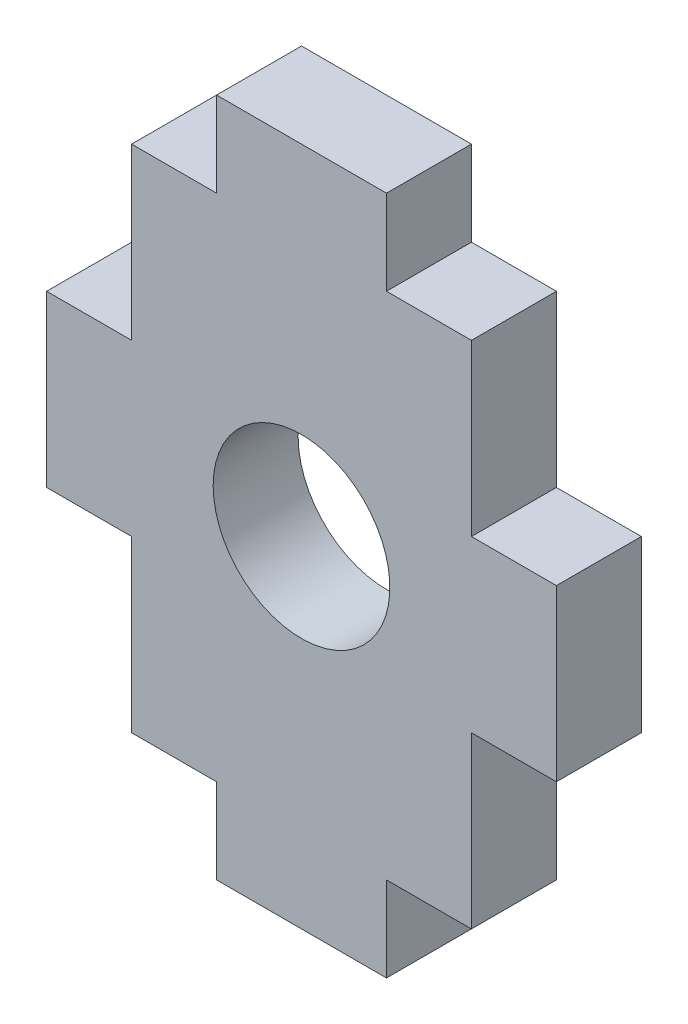
ISO-10303-21;
HEADER;
FILE_DESCRIPTION(('STEP AP214'),'2;1');
FILE_NAME('part.step','',(''),(''),'','','');
FILE_SCHEMA(('AUTOMOTIVE_DESIGN { 1 0 10303 214 1 1 1 1 }'));
ENDSEC;
DATA;
#1=APPLICATION_CONTEXT('core data for automotive mechanical design processes');
#2=APPLICATION_PROTOCOL_DEFINITION('international standard','automotive_design',2000,#1);
#3=PRODUCT_CONTEXT('',#1,'mechanical');
#4=PRODUCT('Part','Part','',(#3));
#5=PRODUCT_RELATED_PRODUCT_CATEGORY('part','',(#4));
#6=PRODUCT_DEFINITION_FORMATION('','',#4);
#7=PRODUCT_DEFINITION_CONTEXT('part definition',#1,'design');
#8=PRODUCT_DEFINITION('design','',#6,#7);
#9=PRODUCT_DEFINITION_SHAPE('','',#8);
#10=(LENGTH_UNIT() NAMED_UNIT(*) SI_UNIT(.MILLI.,.METRE.));
#11=(NAMED_UNIT(*) PLANE_ANGLE_UNIT() SI_UNIT($,.RADIAN.));
#12=(NAMED_UNIT(*) SI_UNIT($,.STERADIAN.) SOLID_ANGLE_UNIT());
#13=UNCERTAINTY_MEASURE_WITH_UNIT(LENGTH_MEASURE(1.E-05),#10,'distance_accuracy_value','');
#14=(GEOMETRIC_REPRESENTATION_CONTEXT(3) GLOBAL_UNCERTAINTY_ASSIGNED_CONTEXT((#13)) GLOBAL_UNIT_ASSIGNED_CONTEXT((#10,
#11,#12)) REPRESENTATION_CONTEXT('',''));
#15=CARTESIAN_POINT('',(0.,0.,0.));
#16=DIRECTION('',(0.,0.,1.));
#17=DIRECTION('',(1.,0.,0.));
#18=AXIS2_PLACEMENT_3D('',#15,#16,#17);
#19=CARTESIAN_POINT('',(-6.35,9.525,3.175));
#20=DIRECTION('',(0.,-1.,0.));
#21=DIRECTION('',(0.,0.,-1.));
#22=AXIS2_PLACEMENT_3D('',#19,#20,#21);
#23=PLANE('',#22);
#24=DIRECTION('',(-1.,0.,0.));
#25=VECTOR('',#24,1.);
#26=CARTESIAN_POINT('',(-6.35,9.525,0.));
#27=LINE('',#26,#25);
#28=CARTESIAN_POINT('',(-3.175,9.525,0.));
#29=VERTEX_POINT('',#28);
#30=CARTESIAN_POINT('',(-6.35,9.525,0.));
#31=VERTEX_POINT('',#30);
#32=EDGE_CURVE('E201',#29,#31,#27,.T.);
#33=ORIENTED_EDGE('',*,*,#32,.T.);
#34=DIRECTION('',(0.,0.,-1.));
#35=VECTOR('',#34,1.);
#36=CARTESIAN_POINT('',(-6.35,9.525,3.175));
#37=LINE('',#36,#35);
#38=CARTESIAN_POINT('',(-6.35,9.525,3.175));
#39=VERTEX_POINT('',#38);
#40=EDGE_CURVE('E11',#39,#31,#37,.T.);
#41=ORIENTED_EDGE('',*,*,#40,.F.);
#42=DIRECTION('',(-1.,0.,0.));
#43=VECTOR('',#42,1.);
#44=CARTESIAN_POINT('',(-6.35,9.525,3.175));
#45=LINE('',#44,#43);
#46=CARTESIAN_POINT('',(-3.175,9.525,3.175));
#47=VERTEX_POINT('',#46);
#48=EDGE_CURVE('E240',#47,#39,#45,.T.);
#49=ORIENTED_EDGE('',*,*,#48,.F.);
#50=DIRECTION('',(0.,0.,-1.));
#51=VECTOR('',#50,1.);
#52=CARTESIAN_POINT('',(-3.175,9.525,3.175));
#53=LINE('',#52,#51);
#54=EDGE_CURVE('E197',#47,#29,#53,.T.);
#55=ORIENTED_EDGE('',*,*,#54,.T.);
#56=EDGE_LOOP('',(#33,#41,#49,#55));
#57=FACE_BOUND('',#56,.T.);
#58=ADVANCED_FACE('F33',(#57),#23,.F.);
#59=CARTESIAN_POINT('',(-6.35,9.525,3.175));
#60=DIRECTION('',(1.,0.,0.));
#61=DIRECTION('',(0.,1.,0.));
#62=AXIS2_PLACEMENT_3D('',#59,#60,#61);
#63=PLANE('',#62);
#64=DIRECTION('',(0.,-1.,0.));
#65=VECTOR('',#64,1.);
#66=CARTESIAN_POINT('',(-6.35,9.525,0.));
#67=LINE('',#66,#65);
#68=CARTESIAN_POINT('',(-6.35,3.175,0.));
#69=VERTEX_POINT('',#68);
#70=EDGE_CURVE('E204',#31,#69,#67,.T.);
#71=ORIENTED_EDGE('',*,*,#70,.T.);
#72=DIRECTION('',(0.,0.,-1.));
#73=VECTOR('',#72,1.);
#74=CARTESIAN_POINT('',(-6.35,3.175,3.175));
#75=LINE('',#74,#73);
#76=CARTESIAN_POINT('',(-6.35,3.175,3.175));
#77=VERTEX_POINT('',#76);
#78=EDGE_CURVE('E41',#77,#69,#75,.T.);
#79=ORIENTED_EDGE('',*,*,#78,.F.);
#80=DIRECTION('',(0.,-1.,0.));
#81=VECTOR('',#80,1.);
#82=CARTESIAN_POINT('',(-6.35,9.525,3.175));
#83=LINE('',#82,#81);
#84=EDGE_CURVE('E128',#39,#77,#83,.T.);
#85=ORIENTED_EDGE('',*,*,#84,.F.);
#86=ORIENTED_EDGE('',*,*,#40,.T.);
#87=EDGE_LOOP('',(#71,#79,#85,#86));
#88=FACE_BOUND('',#87,.T.);
#89=ADVANCED_FACE('F359',(#88),#63,.F.);
#90=CARTESIAN_POINT('',(-6.35,3.175,3.175));
#91=DIRECTION('',(0.,-1.,0.));
#92=DIRECTION('',(1.,0.,0.));
#93=AXIS2_PLACEMENT_3D('',#90,#91,#92);
#94=PLANE('',#93);
#95=DIRECTION('',(-1.,0.,0.));
#96=VECTOR('',#95,1.);
#97=CARTESIAN_POINT('',(-6.35,3.175,0.));
#98=LINE('',#97,#96);
#99=CARTESIAN_POINT('',(-9.525,3.175,0.));
#100=VERTEX_POINT('',#99);
#101=EDGE_CURVE('E207',#69,#100,#98,.T.);
#102=ORIENTED_EDGE('',*,*,#101,.T.);
#103=DIRECTION('',(0.,0.,-1.));
#104=VECTOR('',#103,1.);
#105=CARTESIAN_POINT('',(-9.525,3.175,3.175));
#106=LINE('',#105,#104);
#107=CARTESIAN_POINT('',(-9.525,3.175,3.175));
#108=VERTEX_POINT('',#107);
#109=EDGE_CURVE('E283',#108,#100,#106,.T.);
#110=ORIENTED_EDGE('',*,*,#109,.F.);
#111=DIRECTION('',(-1.,0.,0.));
#112=VECTOR('',#111,1.);
#113=CARTESIAN_POINT('',(-6.35,3.175,3.175));
#114=LINE('',#113,#112);
#115=EDGE_CURVE('E291',#77,#108,#114,.T.);
#116=ORIENTED_EDGE('',*,*,#115,.F.);
#117=ORIENTED_EDGE('',*,*,#78,.T.);
#118=EDGE_LOOP('',(#102,#110,#116,#117));
#119=FACE_BOUND('',#118,.T.);
#120=ADVANCED_FACE('F289',(#119),#94,.F.);
#121=CARTESIAN_POINT('',(-9.525,3.175,3.175));
#122=DIRECTION('',(1.,0.,0.));
#123=DIRECTION('',(0.,0.,-1.));
#124=AXIS2_PLACEMENT_3D('',#121,#122,#123);
#125=PLANE('',#124);
#126=DIRECTION('',(0.,-1.,0.));
#127=VECTOR('',#126,1.);
#128=CARTESIAN_POINT('',(-9.525,3.175,0.));
#129=LINE('',#128,#127);
#130=CARTESIAN_POINT('',(-9.525,-3.175,0.));
#131=VERTEX_POINT('',#130);
#132=EDGE_CURVE('E209',#100,#131,#129,.T.);
#133=ORIENTED_EDGE('',*,*,#132,.T.);
#134=DIRECTION('',(0.,0.,-1.));
#135=VECTOR('',#134,1.);
#136=CARTESIAN_POINT('',(-9.525,-3.175,3.175));
#137=LINE('',#136,#135);
#138=CARTESIAN_POINT('',(-9.525,-3.175,3.175));
#139=VERTEX_POINT('',#138);
#140=EDGE_CURVE('E280',#139,#131,#137,.T.);
#141=ORIENTED_EDGE('',*,*,#140,.F.);
#142=DIRECTION('',(0.,-1.,0.));
#143=VECTOR('',#142,1.);
#144=CARTESIAN_POINT('',(-9.525,3.175,3.175));
#145=LINE('',#144,#143);
#146=EDGE_CURVE('E309',#108,#139,#145,.T.);
#147=ORIENTED_EDGE('',*,*,#146,.F.);
#148=ORIENTED_EDGE('',*,*,#109,.T.);
#149=EDGE_LOOP('',(#133,#141,#147,#148));
#150=FACE_BOUND('',#149,.T.);
#151=ADVANCED_FACE('F300',(#150),#125,.F.);
#152=CARTESIAN_POINT('',(-6.35,-3.175,3.175));
#153=DIRECTION('',(0.,1.,0.));
#154=DIRECTION('',(-1.,0.,0.));
#155=AXIS2_PLACEMENT_3D('',#152,#153,#154);
#156=PLANE('',#155);
#157=DIRECTION('',(1.,0.,0.));
#158=VECTOR('',#157,1.);
#159=CARTESIAN_POINT('',(-6.35,-3.175,0.));
#160=LINE('',#159,#158);
#161=CARTESIAN_POINT('',(-6.35,-3.175,0.));
#162=VERTEX_POINT('',#161);
#163=EDGE_CURVE('E211',#131,#162,#160,.T.);
#164=ORIENTED_EDGE('',*,*,#163,.T.);
#165=DIRECTION('',(0.,0.,-1.));
#166=VECTOR('',#165,1.);
#167=CARTESIAN_POINT('',(-6.35,-3.175,3.175));
#168=LINE('',#167,#166);
#169=CARTESIAN_POINT('',(-6.35,-3.175,3.175));
#170=VERTEX_POINT('',#169);
#171=EDGE_CURVE('E277',#170,#162,#168,.T.);
#172=ORIENTED_EDGE('',*,*,#171,.F.);
#173=DIRECTION('',(1.,0.,0.));
#174=VECTOR('',#173,1.);
#175=CARTESIAN_POINT('',(-6.35,-3.175,3.175));
#176=LINE('',#175,#174);
#177=EDGE_CURVE('E306',#139,#170,#176,.T.);
#178=ORIENTED_EDGE('',*,*,#177,.F.);
#179=ORIENTED_EDGE('',*,*,#140,.T.);
#180=EDGE_LOOP('',(#164,#172,#178,#179));
#181=FACE_BOUND('',#180,.T.);
#182=ADVANCED_FACE('F304',(#181),#156,.F.);
#183=CARTESIAN_POINT('',(-6.35,-9.525,3.175));
#184=DIRECTION('',(1.,0.,0.));
#185=DIRECTION('',(0.,1.,0.));
#186=AXIS2_PLACEMENT_3D('',#183,#184,#185);
#187=PLANE('',#186);
#188=DIRECTION('',(0.,-1.,0.));
#189=VECTOR('',#188,1.);
#190=CARTESIAN_POINT('',(-6.35,-9.525,0.));
#191=LINE('',#190,#189);
#192=CARTESIAN_POINT('',(-6.35,-9.525,0.));
#193=VERTEX_POINT('',#192);
#194=EDGE_CURVE('E213',#162,#193,#191,.T.);
#195=ORIENTED_EDGE('',*,*,#194,.T.);
#196=DIRECTION('',(0.,0.,-1.));
#197=VECTOR('',#196,1.);
#198=CARTESIAN_POINT('',(-6.35,-9.525,3.175));
#199=LINE('',#198,#197);
#200=CARTESIAN_POINT('',(-6.35,-9.525,3.175));
#201=VERTEX_POINT('',#200);
#202=EDGE_CURVE('E274',#201,#193,#199,.T.);
#203=ORIENTED_EDGE('',*,*,#202,.F.);
#204=DIRECTION('',(0.,-1.,0.));
#205=VECTOR('',#204,1.);
#206=CARTESIAN_POINT('',(-6.35,-9.525,3.175));
#207=LINE('',#206,#205);
#208=EDGE_CURVE('E308',#170,#201,#207,.T.);
#209=ORIENTED_EDGE('',*,*,#208,.F.);
#210=ORIENTED_EDGE('',*,*,#171,.T.);
#211=EDGE_LOOP('',(#195,#203,#209,#210));
#212=FACE_BOUND('',#211,.T.);
#213=ADVANCED_FACE('F372',(#212),#187,.F.);
#214=CARTESIAN_POINT('',(-6.35,-9.525,3.175));
#215=DIRECTION('',(0.,1.,0.));
#216=DIRECTION('',(0.,0.,1.));
#217=AXIS2_PLACEMENT_3D('',#214,#215,#216);
#218=PLANE('',#217);
#219=DIRECTION('',(1.,0.,0.));
#220=VECTOR('',#219,1.);
#221=CARTESIAN_POINT('',(-6.35,-9.525,0.));
#222=LINE('',#221,#220);
#223=CARTESIAN_POINT('',(-3.175,-9.525,0.));
#224=VERTEX_POINT('',#223);
#225=EDGE_CURVE('E215',#193,#224,#222,.T.);
#226=ORIENTED_EDGE('',*,*,#225,.T.);
#227=DIRECTION('',(0.,0.,-1.));
#228=VECTOR('',#227,1.);
#229=CARTESIAN_POINT('',(-3.175,-9.525,3.175));
#230=LINE('',#229,#228);
#231=CARTESIAN_POINT('',(-3.175,-9.525,3.175));
#232=VERTEX_POINT('',#231);
#233=EDGE_CURVE('E271',#232,#224,#230,.T.);
#234=ORIENTED_EDGE('',*,*,#233,.F.);
#235=DIRECTION('',(1.,0.,0.));
#236=VECTOR('',#235,1.);
#237=CARTESIAN_POINT('',(-6.35,-9.525,3.175));
#238=LINE('',#237,#236);
#239=EDGE_CURVE('E311',#201,#232,#238,.T.);
#240=ORIENTED_EDGE('',*,*,#239,.F.);
#241=ORIENTED_EDGE('',*,*,#202,.T.);
#242=EDGE_LOOP('',(#226,#234,#240,#241));
#243=FACE_BOUND('',#242,.T.);
#244=ADVANCED_FACE('F375',(#243),#218,.F.);
#245=CARTESIAN_POINT('',(-3.175,-12.7,3.175));
#246=DIRECTION('',(1.,0.,0.));
#247=DIRECTION('',(0.,1.,0.));
#248=AXIS2_PLACEMENT_3D('',#245,#246,#247);
#249=PLANE('',#248);
#250=DIRECTION('',(0.,-1.,0.));
#251=VECTOR('',#250,1.);
#252=CARTESIAN_POINT('',(-3.175,-12.7,0.));
#253=LINE('',#252,#251);
#254=CARTESIAN_POINT('',(-3.175,-12.7,0.));
#255=VERTEX_POINT('',#254);
#256=EDGE_CURVE('E217',#224,#255,#253,.T.);
#257=ORIENTED_EDGE('',*,*,#256,.T.);
#258=DIRECTION('',(0.,0.,-1.));
#259=VECTOR('',#258,1.);
#260=CARTESIAN_POINT('',(-3.175,-12.7,3.175));
#261=LINE('',#260,#259);
#262=CARTESIAN_POINT('',(-3.175,-12.7,3.175));
#263=VERTEX_POINT('',#262);
#264=EDGE_CURVE('E268',#263,#255,#261,.T.);
#265=ORIENTED_EDGE('',*,*,#264,.F.);
#266=DIRECTION('',(0.,-1.,0.));
#267=VECTOR('',#266,1.);
#268=CARTESIAN_POINT('',(-3.175,-12.7,3.175));
#269=LINE('',#268,#267);
#270=EDGE_CURVE('E317',#232,#263,#269,.T.);
#271=ORIENTED_EDGE('',*,*,#270,.F.);
#272=ORIENTED_EDGE('',*,*,#233,.T.);
#273=EDGE_LOOP('',(#257,#265,#271,#272));
#274=FACE_BOUND('',#273,.T.);
#275=ADVANCED_FACE('F379',(#274),#249,.F.);
#276=CARTESIAN_POINT('',(-3.175,-12.7,3.175));
#277=DIRECTION('',(0.,1.,0.));
#278=DIRECTION('',(0.,0.,1.));
#279=AXIS2_PLACEMENT_3D('',#276,#277,#278);
#280=PLANE('',#279);
#281=DIRECTION('',(1.,0.,0.));
#282=VECTOR('',#281,1.);
#283=CARTESIAN_POINT('',(-3.175,-12.7,0.));
#284=LINE('',#283,#282);
#285=CARTESIAN_POINT('',(3.175,-12.7,0.));
#286=VERTEX_POINT('',#285);
#287=EDGE_CURVE('E219',#255,#286,#284,.T.);
#288=ORIENTED_EDGE('',*,*,#287,.T.);
#289=DIRECTION('',(0.,0.,-1.));
#290=VECTOR('',#289,1.);
#291=CARTESIAN_POINT('',(3.175,-12.7,3.175));
#292=LINE('',#291,#290);
#293=CARTESIAN_POINT('',(3.175,-12.7,3.175));
#294=VERTEX_POINT('',#293);
#295=EDGE_CURVE('E265',#294,#286,#292,.T.);
#296=ORIENTED_EDGE('',*,*,#295,.F.);
#297=DIRECTION('',(1.,0.,0.));
#298=VECTOR('',#297,1.);
#299=CARTESIAN_POINT('',(-3.175,-12.7,3.175));
#300=LINE('',#299,#298);
#301=EDGE_CURVE('E319',#263,#294,#300,.T.);
#302=ORIENTED_EDGE('',*,*,#301,.F.);
#303=ORIENTED_EDGE('',*,*,#264,.T.);
#304=EDGE_LOOP('',(#288,#296,#302,#303));
#305=FACE_BOUND('',#304,.T.);
#306=ADVANCED_FACE('F383',(#305),#280,.F.);
#307=CARTESIAN_POINT('',(3.175,-12.7,3.175));
#308=DIRECTION('',(-1.,0.,0.));
#309=DIRECTION('',(0.,-1.,0.));
#310=AXIS2_PLACEMENT_3D('',#307,#308,#309);
#311=PLANE('',#310);
#312=DIRECTION('',(0.,1.,0.));
#313=VECTOR('',#312,1.);
#314=CARTESIAN_POINT('',(3.175,-12.7,0.));
#315=LINE('',#314,#313);
#316=CARTESIAN_POINT('',(3.175,-9.525,0.));
#317=VERTEX_POINT('',#316);
#318=EDGE_CURVE('E221',#286,#317,#315,.T.);
#319=ORIENTED_EDGE('',*,*,#318,.T.);
#320=DIRECTION('',(0.,0.,-1.));
#321=VECTOR('',#320,1.);
#322=CARTESIAN_POINT('',(3.175,-9.525,3.175));
#323=LINE('',#322,#321);
#324=CARTESIAN_POINT('',(3.175,-9.525,3.175));
#325=VERTEX_POINT('',#324);
#326=EDGE_CURVE('E262',#325,#317,#323,.T.);
#327=ORIENTED_EDGE('',*,*,#326,.F.);
#328=DIRECTION('',(0.,1.,0.));
#329=VECTOR('',#328,1.);
#330=CARTESIAN_POINT('',(3.175,-12.7,3.175));
#331=LINE('',#330,#329);
#332=EDGE_CURVE('E321',#294,#325,#331,.T.);
#333=ORIENTED_EDGE('',*,*,#332,.F.);
#334=ORIENTED_EDGE('',*,*,#295,.T.);
#335=EDGE_LOOP('',(#319,#327,#333,#334));
#336=FACE_BOUND('',#335,.T.);
#337=ADVANCED_FACE('F387',(#336),#311,.F.);
#338=CARTESIAN_POINT('',(3.175,-9.525,3.175));
#339=DIRECTION('',(0.,1.,0.));
#340=DIRECTION('',(0.,0.,1.));
#341=AXIS2_PLACEMENT_3D('',#338,#339,#340);
#342=PLANE('',#341);
#343=DIRECTION('',(1.,0.,0.));
#344=VECTOR('',#343,1.);
#345=CARTESIAN_POINT('',(3.175,-9.525,0.));
#346=LINE('',#345,#344);
#347=CARTESIAN_POINT('',(6.35,-9.525,0.));
#348=VERTEX_POINT('',#347);
#349=EDGE_CURVE('E223',#317,#348,#346,.T.);
#350=ORIENTED_EDGE('',*,*,#349,.T.);
#351=DIRECTION('',(0.,0.,-1.));
#352=VECTOR('',#351,1.);
#353=CARTESIAN_POINT('',(6.35,-9.525,3.175));
#354=LINE('',#353,#352);
#355=CARTESIAN_POINT('',(6.35,-9.525,3.175));
#356=VERTEX_POINT('',#355);
#357=EDGE_CURVE('E259',#356,#348,#354,.T.);
#358=ORIENTED_EDGE('',*,*,#357,.F.);
#359=DIRECTION('',(1.,0.,0.));
#360=VECTOR('',#359,1.);
#361=CARTESIAN_POINT('',(3.175,-9.525,3.175));
#362=LINE('',#361,#360);
#363=EDGE_CURVE('E323',#325,#356,#362,.T.);
#364=ORIENTED_EDGE('',*,*,#363,.F.);
#365=ORIENTED_EDGE('',*,*,#326,.T.);
#366=EDGE_LOOP('',(#350,#358,#364,#365));
#367=FACE_BOUND('',#366,.T.);
#368=ADVANCED_FACE('F391',(#367),#342,.F.);
#369=CARTESIAN_POINT('',(6.35,-9.525,3.175));
#370=DIRECTION('',(-1.,0.,0.));
#371=DIRECTION('',(0.,-1.,0.));
#372=AXIS2_PLACEMENT_3D('',#369,#370,#371);
#373=PLANE('',#372);
#374=DIRECTION('',(0.,1.,0.));
#375=VECTOR('',#374,1.);
#376=CARTESIAN_POINT('',(6.35,-9.525,0.));
#377=LINE('',#376,#375);
#378=CARTESIAN_POINT('',(6.35,-3.175,0.));
#379=VERTEX_POINT('',#378);
#380=EDGE_CURVE('E225',#348,#379,#377,.T.);
#381=ORIENTED_EDGE('',*,*,#380,.T.);
#382=DIRECTION('',(0.,0.,-1.));
#383=VECTOR('',#382,1.);
#384=CARTESIAN_POINT('',(6.35,-3.175,3.175));
#385=LINE('',#384,#383);
#386=CARTESIAN_POINT('',(6.35,-3.175,3.175));
#387=VERTEX_POINT('',#386);
#388=EDGE_CURVE('E256',#387,#379,#385,.T.);
#389=ORIENTED_EDGE('',*,*,#388,.F.);
#390=DIRECTION('',(0.,1.,0.));
#391=VECTOR('',#390,1.);
#392=CARTESIAN_POINT('',(6.35,-9.525,3.175));
#393=LINE('',#392,#391);
#394=EDGE_CURVE('E325',#356,#387,#393,.T.);
#395=ORIENTED_EDGE('',*,*,#394,.F.);
#396=ORIENTED_EDGE('',*,*,#357,.T.);
#397=EDGE_LOOP('',(#381,#389,#395,#396));
#398=FACE_BOUND('',#397,.T.);
#399=ADVANCED_FACE('F395',(#398),#373,.F.);
#400=CARTESIAN_POINT('',(6.35,-3.175,3.175));
#401=DIRECTION('',(0.,1.,0.));
#402=DIRECTION('',(-1.,0.,0.));
#403=AXIS2_PLACEMENT_3D('',#400,#401,#402);
#404=PLANE('',#403);
#405=DIRECTION('',(1.,0.,0.));
#406=VECTOR('',#405,1.);
#407=CARTESIAN_POINT('',(6.35,-3.175,0.));
#408=LINE('',#407,#406);
#409=CARTESIAN_POINT('',(9.525,-3.175,0.));
#410=VERTEX_POINT('',#409);
#411=EDGE_CURVE('E227',#379,#410,#408,.T.);
#412=ORIENTED_EDGE('',*,*,#411,.T.);
#413=DIRECTION('',(0.,0.,-1.));
#414=VECTOR('',#413,1.);
#415=CARTESIAN_POINT('',(9.525,-3.175,3.175));
#416=LINE('',#415,#414);
#417=CARTESIAN_POINT('',(9.525,-3.175,3.175));
#418=VERTEX_POINT('',#417);
#419=EDGE_CURVE('E253',#418,#410,#416,.T.);
#420=ORIENTED_EDGE('',*,*,#419,.F.);
#421=DIRECTION('',(1.,0.,0.));
#422=VECTOR('',#421,1.);
#423=CARTESIAN_POINT('',(6.35,-3.175,3.175));
#424=LINE('',#423,#422);
#425=EDGE_CURVE('E327',#387,#418,#424,.T.);
#426=ORIENTED_EDGE('',*,*,#425,.F.);
#427=ORIENTED_EDGE('',*,*,#388,.T.);
#428=EDGE_LOOP('',(#412,#420,#426,#427));
#429=FACE_BOUND('',#428,.T.);
#430=ADVANCED_FACE('F399',(#429),#404,.F.);
#431=CARTESIAN_POINT('',(9.525,3.175,3.175));
#432=DIRECTION('',(-1.,0.,0.));
#433=DIRECTION('',(0.,0.,1.));
#434=AXIS2_PLACEMENT_3D('',#431,#432,#433);
#435=PLANE('',#434);
#436=DIRECTION('',(0.,1.,0.));
#437=VECTOR('',#436,1.);
#438=CARTESIAN_POINT('',(9.525,3.175,0.));
#439=LINE('',#438,#437);
#440=CARTESIAN_POINT('',(9.525,3.175,0.));
#441=VERTEX_POINT('',#440);
#442=EDGE_CURVE('E229',#410,#441,#439,.T.);
#443=ORIENTED_EDGE('',*,*,#442,.T.);
#444=DIRECTION('',(0.,0.,-1.));
#445=VECTOR('',#444,1.);
#446=CARTESIAN_POINT('',(9.525,3.175,3.175));
#447=LINE('',#446,#445);
#448=CARTESIAN_POINT('',(9.525,3.175,3.175));
#449=VERTEX_POINT('',#448);
#450=EDGE_CURVE('E250',#449,#441,#447,.T.);
#451=ORIENTED_EDGE('',*,*,#450,.F.);
#452=DIRECTION('',(0.,1.,0.));
#453=VECTOR('',#452,1.);
#454=CARTESIAN_POINT('',(9.525,3.175,3.175));
#455=LINE('',#454,#453);
#456=EDGE_CURVE('E329',#418,#449,#455,.T.);
#457=ORIENTED_EDGE('',*,*,#456,.F.);
#458=ORIENTED_EDGE('',*,*,#419,.T.);
#459=EDGE_LOOP('',(#443,#451,#457,#458));
#460=FACE_BOUND('',#459,.T.);
#461=ADVANCED_FACE('F403',(#460),#435,.F.);
#462=CARTESIAN_POINT('',(6.35,3.175,3.175));
#463=DIRECTION('',(0.,-1.,0.));
#464=DIRECTION('',(1.,0.,0.));
#465=AXIS2_PLACEMENT_3D('',#462,#463,#464);
#466=PLANE('',#465);
#467=DIRECTION('',(-1.,0.,0.));
#468=VECTOR('',#467,1.);
#469=CARTESIAN_POINT('',(6.35,3.175,0.));
#470=LINE('',#469,#468);
#471=CARTESIAN_POINT('',(6.35,3.175,0.));
#472=VERTEX_POINT('',#471);
#473=EDGE_CURVE('E231',#441,#472,#470,.T.);
#474=ORIENTED_EDGE('',*,*,#473,.T.);
#475=DIRECTION('',(0.,0.,-1.));
#476=VECTOR('',#475,1.);
#477=CARTESIAN_POINT('',(6.35,3.175,3.175));
#478=LINE('',#477,#476);
#479=CARTESIAN_POINT('',(6.35,3.175,3.175));
#480=VERTEX_POINT('',#479);
#481=EDGE_CURVE('E247',#480,#472,#478,.T.);
#482=ORIENTED_EDGE('',*,*,#481,.F.);
#483=DIRECTION('',(-1.,0.,0.));
#484=VECTOR('',#483,1.);
#485=CARTESIAN_POINT('',(6.35,3.175,3.175));
#486=LINE('',#485,#484);
#487=EDGE_CURVE('E331',#449,#480,#486,.T.);
#488=ORIENTED_EDGE('',*,*,#487,.F.);
#489=ORIENTED_EDGE('',*,*,#450,.T.);
#490=EDGE_LOOP('',(#474,#482,#488,#489));
#491=FACE_BOUND('',#490,.T.);
#492=ADVANCED_FACE('F407',(#491),#466,.F.);
#493=CARTESIAN_POINT('',(6.35,9.525,3.175));
#494=DIRECTION('',(-1.,0.,0.));
#495=DIRECTION('',(0.,-1.,0.));
#496=AXIS2_PLACEMENT_3D('',#493,#494,#495);
#497=PLANE('',#496);
#498=DIRECTION('',(0.,1.,0.));
#499=VECTOR('',#498,1.);
#500=CARTESIAN_POINT('',(6.35,9.525,0.));
#501=LINE('',#500,#499);
#502=CARTESIAN_POINT('',(6.35,9.525,0.));
#503=VERTEX_POINT('',#502);
#504=EDGE_CURVE('E233',#472,#503,#501,.T.);
#505=ORIENTED_EDGE('',*,*,#504,.T.);
#506=DIRECTION('',(0.,0.,-1.));
#507=VECTOR('',#506,1.);
#508=CARTESIAN_POINT('',(6.35,9.525,3.175));
#509=LINE('',#508,#507);
#510=CARTESIAN_POINT('',(6.35,9.525,3.175));
#511=VERTEX_POINT('',#510);
#512=EDGE_CURVE('E244',#511,#503,#509,.T.);
#513=ORIENTED_EDGE('',*,*,#512,.F.);
#514=DIRECTION('',(0.,1.,0.));
#515=VECTOR('',#514,1.);
#516=CARTESIAN_POINT('',(6.35,9.525,3.175));
#517=LINE('',#516,#515);
#518=EDGE_CURVE('E333',#480,#511,#517,.T.);
#519=ORIENTED_EDGE('',*,*,#518,.F.);
#520=ORIENTED_EDGE('',*,*,#481,.T.);
#521=EDGE_LOOP('',(#505,#513,#519,#520));
#522=FACE_BOUND('',#521,.T.);
#523=ADVANCED_FACE('F339',(#522),#497,.F.);
#524=CARTESIAN_POINT('',(3.175,9.525,3.175));
#525=DIRECTION('',(0.,-1.,0.));
#526=DIRECTION('',(0.,0.,-1.));
#527=AXIS2_PLACEMENT_3D('',#524,#525,#526);
#528=PLANE('',#527);
#529=DIRECTION('',(-1.,0.,0.));
#530=VECTOR('',#529,1.);
#531=CARTESIAN_POINT('',(3.175,9.525,0.));
#532=LINE('',#531,#530);
#533=CARTESIAN_POINT('',(3.175,9.525,0.));
#534=VERTEX_POINT('',#533);
#535=EDGE_CURVE('E235',#503,#534,#532,.T.);
#536=ORIENTED_EDGE('',*,*,#535,.T.);
#537=DIRECTION('',(0.,0.,-1.));
#538=VECTOR('',#537,1.);
#539=CARTESIAN_POINT('',(3.175,9.525,3.175));
#540=LINE('',#539,#538);
#541=CARTESIAN_POINT('',(3.175,9.525,3.175));
#542=VERTEX_POINT('',#541);
#543=EDGE_CURVE('E192',#542,#534,#540,.T.);
#544=ORIENTED_EDGE('',*,*,#543,.F.);
#545=DIRECTION('',(-1.,0.,0.));
#546=VECTOR('',#545,1.);
#547=CARTESIAN_POINT('',(3.175,9.525,3.175));
#548=LINE('',#547,#546);
#549=EDGE_CURVE('E183',#511,#542,#548,.T.);
#550=ORIENTED_EDGE('',*,*,#549,.F.);
#551=ORIENTED_EDGE('',*,*,#512,.T.);
#552=EDGE_LOOP('',(#536,#544,#550,#551));
#553=FACE_BOUND('',#552,.T.);
#554=ADVANCED_FACE('F343',(#553),#528,.F.);
#555=CARTESIAN_POINT('',(3.175,12.7,3.175));
#556=DIRECTION('',(-1.,0.,0.));
#557=DIRECTION('',(0.,-1.,0.));
#558=AXIS2_PLACEMENT_3D('',#555,#556,#557);
#559=PLANE('',#558);
#560=DIRECTION('',(0.,1.,0.));
#561=VECTOR('',#560,1.);
#562=CARTESIAN_POINT('',(3.175,12.7,0.));
#563=LINE('',#562,#561);
#564=CARTESIAN_POINT('',(3.175,12.7,0.));
#565=VERTEX_POINT('',#564);
#566=EDGE_CURVE('E191',#534,#565,#563,.T.);
#567=ORIENTED_EDGE('',*,*,#566,.T.);
#568=DIRECTION('',(0.,0.,-1.));
#569=VECTOR('',#568,1.);
#570=CARTESIAN_POINT('',(3.175,12.7,3.175));
#571=LINE('',#570,#569);
#572=CARTESIAN_POINT('',(3.175,12.7,3.175));
#573=VERTEX_POINT('',#572);
#574=EDGE_CURVE('E188',#573,#565,#571,.T.);
#575=ORIENTED_EDGE('',*,*,#574,.F.);
#576=DIRECTION('',(0.,1.,0.));
#577=VECTOR('',#576,1.);
#578=CARTESIAN_POINT('',(3.175,12.7,3.175));
#579=LINE('',#578,#577);
#580=EDGE_CURVE('E177',#542,#573,#579,.T.);
#581=ORIENTED_EDGE('',*,*,#580,.F.);
#582=ORIENTED_EDGE('',*,*,#543,.T.);
#583=EDGE_LOOP('',(#567,#575,#581,#582));
#584=FACE_BOUND('',#583,.T.);
#585=ADVANCED_FACE('F189',(#584),#559,.F.);
#586=CARTESIAN_POINT('',(-3.175,12.7,3.175));
#587=DIRECTION('',(0.,-1.,0.));
#588=DIRECTION('',(0.,0.,-1.));
#589=AXIS2_PLACEMENT_3D('',#586,#587,#588);
#590=PLANE('',#589);
#591=DIRECTION('',(-1.,0.,0.));
#592=VECTOR('',#591,1.);
#593=CARTESIAN_POINT('',(-3.175,12.7,0.));
#594=LINE('',#593,#592);
#595=CARTESIAN_POINT('',(-3.175,12.7,0.));
#596=VERTEX_POINT('',#595);
#597=EDGE_CURVE('E114',#565,#596,#594,.T.);
#598=ORIENTED_EDGE('',*,*,#597,.T.);
#599=DIRECTION('',(0.,0.,-1.));
#600=VECTOR('',#599,1.);
#601=CARTESIAN_POINT('',(-3.175,12.7,3.175));
#602=LINE('',#601,#600);
#603=CARTESIAN_POINT('',(-3.175,12.7,3.175));
#604=VERTEX_POINT('',#603);
#605=EDGE_CURVE('E193',#604,#596,#602,.T.);
#606=ORIENTED_EDGE('',*,*,#605,.F.);
#607=DIRECTION('',(-1.,0.,0.));
#608=VECTOR('',#607,1.);
#609=CARTESIAN_POINT('',(-3.175,12.7,3.175));
#610=LINE('',#609,#608);
#611=EDGE_CURVE('E181',#573,#604,#610,.T.);
#612=ORIENTED_EDGE('',*,*,#611,.F.);
#613=ORIENTED_EDGE('',*,*,#574,.T.);
#614=EDGE_LOOP('',(#598,#606,#612,#613));
#615=FACE_BOUND('',#614,.T.);
#616=ADVANCED_FACE('F195',(#615),#590,.F.);
#617=CARTESIAN_POINT('',(-3.175,12.7,3.175));
#618=DIRECTION('',(1.,0.,0.));
#619=DIRECTION('',(0.,1.,0.));
#620=AXIS2_PLACEMENT_3D('',#617,#618,#619);
#621=PLANE('',#620);
#622=DIRECTION('',(0.,-1.,0.));
#623=VECTOR('',#622,1.);
#624=CARTESIAN_POINT('',(-3.175,12.7,0.));
#625=LINE('',#624,#623);
#626=EDGE_CURVE('E120',#596,#29,#625,.T.);
#627=ORIENTED_EDGE('',*,*,#626,.T.);
#628=ORIENTED_EDGE('',*,*,#54,.F.);
#629=DIRECTION('',(0.,-1.,0.));
#630=VECTOR('',#629,1.);
#631=CARTESIAN_POINT('',(-3.175,12.7,3.175));
#632=LINE('',#631,#630);
#633=EDGE_CURVE('E49',#604,#47,#632,.T.);
#634=ORIENTED_EDGE('',*,*,#633,.F.);
#635=ORIENTED_EDGE('',*,*,#605,.T.);
#636=EDGE_LOOP('',(#627,#628,#634,#635));
#637=FACE_BOUND('',#636,.T.);
#638=ADVANCED_FACE('F347',(#637),#621,.F.);
#639=CARTESIAN_POINT('',(9.525,9.525,3.175));
#640=DIRECTION('',(0.,0.,-1.));
#641=DIRECTION('',(-1.,0.,0.));
#642=AXIS2_PLACEMENT_3D('',#639,#640,#641);
#643=PLANE('',#642);
#644=CARTESIAN_POINT('',(0.,0.,3.175));
#645=DIRECTION('',(0.,0.,-1.));
#646=DIRECTION('',(-1.,0.,0.));
#647=AXIS2_PLACEMENT_3D('',#644,#645,#646);
#648=CIRCLE('',#647,3.302);
#649=CARTESIAN_POINT('',(-3.302,0.,3.175));
#650=VERTEX_POINT('',#649);
#651=EDGE_CURVE('E205',#650,#650,#648,.T.);
#652=ORIENTED_EDGE('',*,*,#651,.T.);
#653=EDGE_LOOP('',(#652));
#654=FACE_BOUND('',#653,.T.);
#655=ORIENTED_EDGE('',*,*,#48,.T.);
#656=ORIENTED_EDGE('',*,*,#84,.T.);
#657=ORIENTED_EDGE('',*,*,#115,.T.);
#658=ORIENTED_EDGE('',*,*,#146,.T.);
#659=ORIENTED_EDGE('',*,*,#177,.T.);
#660=ORIENTED_EDGE('',*,*,#208,.T.);
#661=ORIENTED_EDGE('',*,*,#239,.T.);
#662=ORIENTED_EDGE('',*,*,#270,.T.);
#663=ORIENTED_EDGE('',*,*,#301,.T.);
#664=ORIENTED_EDGE('',*,*,#332,.T.);
#665=ORIENTED_EDGE('',*,*,#363,.T.);
#666=ORIENTED_EDGE('',*,*,#394,.T.);
#667=ORIENTED_EDGE('',*,*,#425,.T.);
#668=ORIENTED_EDGE('',*,*,#456,.T.);
#669=ORIENTED_EDGE('',*,*,#487,.T.);
#670=ORIENTED_EDGE('',*,*,#518,.T.);
#671=ORIENTED_EDGE('',*,*,#549,.T.);
#672=ORIENTED_EDGE('',*,*,#580,.T.);
#673=ORIENTED_EDGE('',*,*,#611,.T.);
#674=ORIENTED_EDGE('',*,*,#633,.T.);
#675=EDGE_LOOP('',(#655,#656,#657,#658,#659,#660,#661,#662,#663,#664,#665,#666,#667,#668,#669,
#670,#671,#672,#673,#674));
#676=FACE_BOUND('',#675,.T.);
#677=ADVANCED_FACE('F179',(#654,#676),#643,.F.);
#678=CARTESIAN_POINT('',(9.525,9.525,0.));
#679=DIRECTION('',(0.,0.,-1.));
#680=DIRECTION('',(-1.,0.,0.));
#681=AXIS2_PLACEMENT_3D('',#678,#679,#680);
#682=PLANE('',#681);
#683=CARTESIAN_POINT('',(0.,0.,0.));
#684=DIRECTION('',(0.,0.,-1.));
#685=DIRECTION('',(-1.,0.,0.));
#686=AXIS2_PLACEMENT_3D('',#683,#684,#685);
#687=CIRCLE('',#686,3.302);
#688=CARTESIAN_POINT('',(-3.302,0.,0.));
#689=VERTEX_POINT('',#688);
#690=EDGE_CURVE('E462',#689,#689,#687,.T.);
#691=ORIENTED_EDGE('',*,*,#690,.F.);
#692=EDGE_LOOP('',(#691));
#693=FACE_BOUND('',#692,.T.);
#694=ORIENTED_EDGE('',*,*,#32,.F.);
#695=ORIENTED_EDGE('',*,*,#626,.F.);
#696=ORIENTED_EDGE('',*,*,#597,.F.);
#697=ORIENTED_EDGE('',*,*,#566,.F.);
#698=ORIENTED_EDGE('',*,*,#535,.F.);
#699=ORIENTED_EDGE('',*,*,#504,.F.);
#700=ORIENTED_EDGE('',*,*,#473,.F.);
#701=ORIENTED_EDGE('',*,*,#442,.F.);
#702=ORIENTED_EDGE('',*,*,#411,.F.);
#703=ORIENTED_EDGE('',*,*,#380,.F.);
#704=ORIENTED_EDGE('',*,*,#349,.F.);
#705=ORIENTED_EDGE('',*,*,#318,.F.);
#706=ORIENTED_EDGE('',*,*,#287,.F.);
#707=ORIENTED_EDGE('',*,*,#256,.F.);
#708=ORIENTED_EDGE('',*,*,#225,.F.);
#709=ORIENTED_EDGE('',*,*,#194,.F.);
#710=ORIENTED_EDGE('',*,*,#163,.F.);
#711=ORIENTED_EDGE('',*,*,#132,.F.);
#712=ORIENTED_EDGE('',*,*,#101,.F.);
#713=ORIENTED_EDGE('',*,*,#70,.F.);
#714=EDGE_LOOP('',(#694,#695,#696,#697,#698,#699,#700,#701,#702,#703,#704,#705,#706,#707,#708,
#709,#710,#711,#712,#713));
#715=FACE_BOUND('',#714,.T.);
#716=ADVANCED_FACE('F295',(#693,#715),#682,.T.);
#717=CARTESIAN_POINT('',(0.,0.,3.175));
#718=DIRECTION('',(0.,0.,-1.));
#719=DIRECTION('',(-1.,0.,0.));
#720=AXIS2_PLACEMENT_3D('',#717,#718,#719);
#721=CYLINDRICAL_SURFACE('',#720,3.302);
#722=ORIENTED_EDGE('',*,*,#651,.F.);
#723=EDGE_LOOP('',(#722));
#724=FACE_BOUND('',#723,.T.);
#725=ORIENTED_EDGE('',*,*,#690,.T.);
#726=EDGE_LOOP('',(#725));
#727=FACE_BOUND('',#726,.T.);
#728=ADVANCED_FACE('F444',(#724,#727),#721,.F.);
#729=CLOSED_SHELL('',(#58,#89,#120,#151,#182,#213,#244,#275,#306,#337,#368,#399,#430,#461,#492,
#523,#554,#585,#616,#638,#677,#716,#728));
#730=MANIFOLD_SOLID_BREP('B2',#729);
#731=ADVANCED_BREP_SHAPE_REPRESENTATION('',(#18,#730),#14);
#732=SHAPE_DEFINITION_REPRESENTATION(#9,#731);
ENDSEC;
END-ISO-10303-21;
